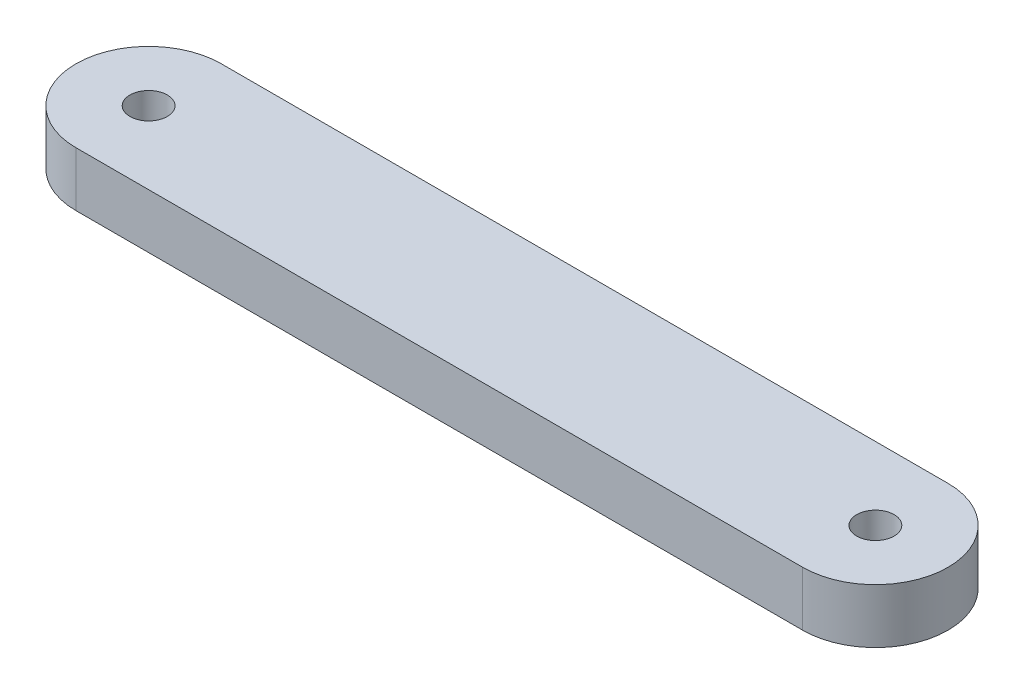
ISO-10303-21;
HEADER;
FILE_DESCRIPTION(('STEP AP214'),'2;1');
FILE_NAME('part.step','',(''),(''),'','','');
FILE_SCHEMA(('AUTOMOTIVE_DESIGN { 1 0 10303 214 1 1 1 1 }'));
ENDSEC;
DATA;
#1=APPLICATION_CONTEXT('core data for automotive mechanical design processes');
#2=APPLICATION_PROTOCOL_DEFINITION('international standard','automotive_design',2000,#1);
#3=PRODUCT_CONTEXT('',#1,'mechanical');
#4=PRODUCT('Part','Part','',(#3));
#5=PRODUCT_RELATED_PRODUCT_CATEGORY('part','',(#4));
#6=PRODUCT_DEFINITION_FORMATION('','',#4);
#7=PRODUCT_DEFINITION_CONTEXT('part definition',#1,'design');
#8=PRODUCT_DEFINITION('design','',#6,#7);
#9=PRODUCT_DEFINITION_SHAPE('','',#8);
#10=(LENGTH_UNIT() NAMED_UNIT(*) SI_UNIT(.MILLI.,.METRE.));
#11=(NAMED_UNIT(*) PLANE_ANGLE_UNIT() SI_UNIT($,.RADIAN.));
#12=(NAMED_UNIT(*) SI_UNIT($,.STERADIAN.) SOLID_ANGLE_UNIT());
#13=UNCERTAINTY_MEASURE_WITH_UNIT(LENGTH_MEASURE(1.E-05),#10,'distance_accuracy_value','');
#14=(GEOMETRIC_REPRESENTATION_CONTEXT(3) GLOBAL_UNCERTAINTY_ASSIGNED_CONTEXT((#13)) GLOBAL_UNIT_ASSIGNED_CONTEXT((#10,
#11,#12)) REPRESENTATION_CONTEXT('',''));
#15=CARTESIAN_POINT('',(0.,0.,0.));
#16=DIRECTION('',(0.,0.,1.));
#17=DIRECTION('',(1.,0.,0.));
#18=AXIS2_PLACEMENT_3D('',#15,#16,#17);
#19=CARTESIAN_POINT('',(0.,4.7625,6.35));
#20=DIRECTION('',(0.,0.,-1.));
#21=DIRECTION('',(-1.,0.,0.));
#22=AXIS2_PLACEMENT_3D('',#19,#20,#21);
#23=PLANE('',#22);
#24=DIRECTION('',(1.,0.,0.));
#25=VECTOR('',#24,1.);
#26=CARTESIAN_POINT('',(0.,0.,6.35));
#27=LINE('',#26,#25);
#28=CARTESIAN_POINT('',(-63.5,0.,6.35));
#29=VERTEX_POINT('',#28);
#30=CARTESIAN_POINT('',(0.,0.,6.35));
#31=VERTEX_POINT('',#30);
#32=EDGE_CURVE('E97',#29,#31,#27,.T.);
#33=ORIENTED_EDGE('',*,*,#32,.T.);
#34=DIRECTION('',(0.,-1.,0.));
#35=VECTOR('',#34,1.);
#36=CARTESIAN_POINT('',(0.,4.7625,6.35));
#37=LINE('',#36,#35);
#38=CARTESIAN_POINT('',(0.,4.7625,6.35));
#39=VERTEX_POINT('',#38);
#40=EDGE_CURVE('E11',#39,#31,#37,.T.);
#41=ORIENTED_EDGE('',*,*,#40,.F.);
#42=DIRECTION('',(1.,0.,0.));
#43=VECTOR('',#42,1.);
#44=CARTESIAN_POINT('',(0.,4.7625,6.35));
#45=LINE('',#44,#43);
#46=CARTESIAN_POINT('',(-63.5,4.7625,6.35));
#47=VERTEX_POINT('',#46);
#48=EDGE_CURVE('E82',#47,#39,#45,.T.);
#49=ORIENTED_EDGE('',*,*,#48,.F.);
#50=DIRECTION('',(0.,-1.,0.));
#51=VECTOR('',#50,1.);
#52=CARTESIAN_POINT('',(-63.5,4.7625,6.35));
#53=LINE('',#52,#51);
#54=EDGE_CURVE('E93',#47,#29,#53,.T.);
#55=ORIENTED_EDGE('',*,*,#54,.T.);
#56=EDGE_LOOP('',(#33,#41,#49,#55));
#57=FACE_BOUND('',#56,.T.);
#58=ADVANCED_FACE('F35',(#57),#23,.F.);
#59=CARTESIAN_POINT('',(0.,4.7625,0.));
#60=DIRECTION('',(0.,-1.,0.));
#61=DIRECTION('',(0.,0.,-1.));
#62=AXIS2_PLACEMENT_3D('',#59,#60,#61);
#63=CYLINDRICAL_SURFACE('',#62,6.35);
#64=CARTESIAN_POINT('',(0.,0.,0.));
#65=DIRECTION('',(0.,1.,0.));
#66=DIRECTION('',(0.,0.,1.));
#67=AXIS2_PLACEMENT_3D('',#64,#65,#66);
#68=CIRCLE('',#67,6.35);
#69=CARTESIAN_POINT('',(0.,0.,-6.35));
#70=VERTEX_POINT('',#69);
#71=EDGE_CURVE('E87',#31,#70,#68,.T.);
#72=ORIENTED_EDGE('',*,*,#71,.T.);
#73=DIRECTION('',(0.,-1.,0.));
#74=VECTOR('',#73,1.);
#75=CARTESIAN_POINT('',(0.,4.7625,-6.35));
#76=LINE('',#75,#74);
#77=CARTESIAN_POINT('',(0.,4.7625,-6.35));
#78=VERTEX_POINT('',#77);
#79=EDGE_CURVE('E43',#78,#70,#76,.T.);
#80=ORIENTED_EDGE('',*,*,#79,.F.);
#81=CARTESIAN_POINT('',(0.,4.7625,0.));
#82=DIRECTION('',(0.,1.,0.));
#83=DIRECTION('',(0.,0.,1.));
#84=AXIS2_PLACEMENT_3D('',#81,#82,#83);
#85=CIRCLE('',#84,6.35);
#86=EDGE_CURVE('E77',#39,#78,#85,.T.);
#87=ORIENTED_EDGE('',*,*,#86,.F.);
#88=ORIENTED_EDGE('',*,*,#40,.T.);
#89=EDGE_LOOP('',(#72,#80,#87,#88));
#90=FACE_BOUND('',#89,.T.);
#91=ADVANCED_FACE('F86',(#90),#63,.T.);
#92=CARTESIAN_POINT('',(0.,4.7625,-6.35));
#93=DIRECTION('',(0.,0.,-1.));
#94=DIRECTION('',(-1.,0.,0.));
#95=AXIS2_PLACEMENT_3D('',#92,#93,#94);
#96=PLANE('',#95);
#97=DIRECTION('',(1.,0.,0.));
#98=VECTOR('',#97,1.);
#99=CARTESIAN_POINT('',(0.,0.,-6.35));
#100=LINE('',#99,#98);
#101=CARTESIAN_POINT('',(-63.5,0.,-6.35));
#102=VERTEX_POINT('',#101);
#103=EDGE_CURVE('E102',#102,#70,#100,.T.);
#104=ORIENTED_EDGE('',*,*,#103,.F.);
#105=DIRECTION('',(0.,-1.,0.));
#106=VECTOR('',#105,1.);
#107=CARTESIAN_POINT('',(-63.5,4.7625,-6.35));
#108=LINE('',#107,#106);
#109=CARTESIAN_POINT('',(-63.5,4.7625,-6.35));
#110=VERTEX_POINT('',#109);
#111=EDGE_CURVE('E67',#110,#102,#108,.T.);
#112=ORIENTED_EDGE('',*,*,#111,.F.);
#113=DIRECTION('',(1.,0.,0.));
#114=VECTOR('',#113,1.);
#115=CARTESIAN_POINT('',(0.,4.7625,-6.35));
#116=LINE('',#115,#114);
#117=EDGE_CURVE('E80',#110,#78,#116,.T.);
#118=ORIENTED_EDGE('',*,*,#117,.T.);
#119=ORIENTED_EDGE('',*,*,#79,.T.);
#120=EDGE_LOOP('',(#104,#112,#118,#119));
#121=FACE_BOUND('',#120,.T.);
#122=ADVANCED_FACE('F91',(#121),#96,.T.);
#123=CARTESIAN_POINT('',(-63.5,4.7625,0.));
#124=DIRECTION('',(0.,-1.,0.));
#125=DIRECTION('',(0.,0.,-1.));
#126=AXIS2_PLACEMENT_3D('',#123,#124,#125);
#127=CYLINDRICAL_SURFACE('',#126,6.35);
#128=CARTESIAN_POINT('',(-63.5,0.,0.));
#129=DIRECTION('',(0.,1.,0.));
#130=DIRECTION('',(0.,0.,1.));
#131=AXIS2_PLACEMENT_3D('',#128,#129,#130);
#132=CIRCLE('',#131,6.35);
#133=EDGE_CURVE('E70',#102,#29,#132,.T.);
#134=ORIENTED_EDGE('',*,*,#133,.T.);
#135=ORIENTED_EDGE('',*,*,#54,.F.);
#136=CARTESIAN_POINT('',(-63.5,4.7625,0.));
#137=DIRECTION('',(0.,1.,0.));
#138=DIRECTION('',(0.,0.,1.));
#139=AXIS2_PLACEMENT_3D('',#136,#137,#138);
#140=CIRCLE('',#139,6.35);
#141=EDGE_CURVE('E51',#110,#47,#140,.T.);
#142=ORIENTED_EDGE('',*,*,#141,.F.);
#143=ORIENTED_EDGE('',*,*,#111,.T.);
#144=EDGE_LOOP('',(#134,#135,#142,#143));
#145=FACE_BOUND('',#144,.T.);
#146=ADVANCED_FACE('F121',(#145),#127,.T.);
#147=CARTESIAN_POINT('',(0.,4.7625,0.));
#148=DIRECTION('',(0.,1.,0.));
#149=DIRECTION('',(0.,0.,1.));
#150=AXIS2_PLACEMENT_3D('',#147,#148,#149);
#151=PLANE('',#150);
#152=CARTESIAN_POINT('',(0.,4.7625,0.));
#153=DIRECTION('',(0.,-1.,0.));
#154=DIRECTION('',(0.,0.,-1.));
#155=AXIS2_PLACEMENT_3D('',#152,#153,#154);
#156=CIRCLE('',#155,1.63195);
#157=CARTESIAN_POINT('',(0.,4.7625,-1.63195));
#158=VERTEX_POINT('',#157);
#159=EDGE_CURVE('E181',#158,#158,#156,.T.);
#160=ORIENTED_EDGE('',*,*,#159,.T.);
#161=EDGE_LOOP('',(#160));
#162=FACE_BOUND('',#161,.T.);
#163=CARTESIAN_POINT('',(-63.5,4.7625,0.));
#164=DIRECTION('',(0.,1.,0.));
#165=DIRECTION('',(0.,0.,1.));
#166=AXIS2_PLACEMENT_3D('',#163,#164,#165);
#167=CIRCLE('',#166,1.63195);
#168=CARTESIAN_POINT('',(-63.5,4.7625,1.63195));
#169=VERTEX_POINT('',#168);
#170=EDGE_CURVE('E186',#169,#169,#167,.T.);
#171=ORIENTED_EDGE('',*,*,#170,.F.);
#172=EDGE_LOOP('',(#171));
#173=FACE_BOUND('',#172,.T.);
#174=ORIENTED_EDGE('',*,*,#48,.T.);
#175=ORIENTED_EDGE('',*,*,#86,.T.);
#176=ORIENTED_EDGE('',*,*,#117,.F.);
#177=ORIENTED_EDGE('',*,*,#141,.T.);
#178=EDGE_LOOP('',(#174,#175,#176,#177));
#179=FACE_BOUND('',#178,.T.);
#180=ADVANCED_FACE('F78',(#162,#173,#179),#151,.T.);
#181=CARTESIAN_POINT('',(0.,0.,0.));
#182=DIRECTION('',(0.,1.,0.));
#183=DIRECTION('',(0.,0.,1.));
#184=AXIS2_PLACEMENT_3D('',#181,#182,#183);
#185=PLANE('',#184);
#186=CARTESIAN_POINT('',(0.,0.,0.));
#187=DIRECTION('',(0.,-1.,0.));
#188=DIRECTION('',(0.,0.,-1.));
#189=AXIS2_PLACEMENT_3D('',#186,#187,#188);
#190=CIRCLE('',#189,3.2385);
#191=CARTESIAN_POINT('',(0.,0.,-3.2385));
#192=VERTEX_POINT('',#191);
#193=EDGE_CURVE('E179',#192,#192,#190,.T.);
#194=ORIENTED_EDGE('',*,*,#193,.F.);
#195=EDGE_LOOP('',(#194));
#196=FACE_BOUND('',#195,.T.);
#197=CARTESIAN_POINT('',(-63.5,0.,0.));
#198=DIRECTION('',(0.,1.,0.));
#199=DIRECTION('',(0.,0.,1.));
#200=AXIS2_PLACEMENT_3D('',#197,#198,#199);
#201=CIRCLE('',#200,1.63195);
#202=CARTESIAN_POINT('',(-63.5,0.,1.63195));
#203=VERTEX_POINT('',#202);
#204=EDGE_CURVE('E100',#203,#203,#201,.T.);
#205=ORIENTED_EDGE('',*,*,#204,.T.);
#206=EDGE_LOOP('',(#205));
#207=FACE_BOUND('',#206,.T.);
#208=ORIENTED_EDGE('',*,*,#32,.F.);
#209=ORIENTED_EDGE('',*,*,#133,.F.);
#210=ORIENTED_EDGE('',*,*,#103,.T.);
#211=ORIENTED_EDGE('',*,*,#71,.F.);
#212=EDGE_LOOP('',(#208,#209,#210,#211));
#213=FACE_BOUND('',#212,.T.);
#214=ADVANCED_FACE('F109',(#196,#207,#213),#185,.F.);
#215=CARTESIAN_POINT('',(-63.5,4.7625,0.));
#216=DIRECTION('',(0.,1.,0.));
#217=DIRECTION('',(0.,0.,1.));
#218=AXIS2_PLACEMENT_3D('',#215,#216,#217);
#219=CYLINDRICAL_SURFACE('',#218,1.63195);
#220=ORIENTED_EDGE('',*,*,#204,.F.);
#221=EDGE_LOOP('',(#220));
#222=FACE_BOUND('',#221,.T.);
#223=ORIENTED_EDGE('',*,*,#170,.T.);
#224=EDGE_LOOP('',(#223));
#225=FACE_BOUND('',#224,.T.);
#226=ADVANCED_FACE('F111',(#222,#225),#219,.F.);
#227=CARTESIAN_POINT('',(0.,0.,0.));
#228=DIRECTION('',(0.,-1.,0.));
#229=DIRECTION('',(0.,0.,-1.));
#230=AXIS2_PLACEMENT_3D('',#227,#228,#229);
#231=CYLINDRICAL_SURFACE('',#230,1.63194999999999);
#232=ORIENTED_EDGE('',*,*,#159,.F.);
#233=EDGE_LOOP('',(#232));
#234=FACE_BOUND('',#233,.T.);
#235=CARTESIAN_POINT('',(0.,1.84812436462092,0.));
#236=DIRECTION('',(0.,-1.,0.));
#237=DIRECTION('',(0.,0.,-1.));
#238=AXIS2_PLACEMENT_3D('',#235,#236,#237);
#239=CIRCLE('',#238,1.63194999999999);
#240=CARTESIAN_POINT('',(0.,1.84812436462092,-1.63194999999999));
#241=VERTEX_POINT('',#240);
#242=EDGE_CURVE('E177',#241,#241,#239,.T.);
#243=ORIENTED_EDGE('',*,*,#242,.T.);
#244=EDGE_LOOP('',(#243));
#245=FACE_BOUND('',#244,.T.);
#246=ADVANCED_FACE('F118',(#234,#245),#231,.F.);
#247=CARTESIAN_POINT('',(0.,0.,0.));
#248=DIRECTION('',(0.,-1.,0.));
#249=DIRECTION('',(0.,0.,-1.));
#250=AXIS2_PLACEMENT_3D('',#247,#248,#249);
#251=CONICAL_SURFACE('',#250,3.2385,0.715584993317676);
#252=ORIENTED_EDGE('',*,*,#242,.F.);
#253=EDGE_LOOP('',(#252));
#254=FACE_BOUND('',#253,.T.);
#255=ORIENTED_EDGE('',*,*,#193,.T.);
#256=EDGE_LOOP('',(#255));
#257=FACE_BOUND('',#256,.T.);
#258=ADVANCED_FACE('F160',(#254,#257),#251,.F.);
#259=CLOSED_SHELL('',(#58,#91,#122,#146,#180,#214,#226,#246,#258));
#260=MANIFOLD_SOLID_BREP('B2',#259);
#261=ADVANCED_BREP_SHAPE_REPRESENTATION('',(#18,#260),#14);
#262=SHAPE_DEFINITION_REPRESENTATION(#9,#261);
ENDSEC;
END-ISO-10303-21;
